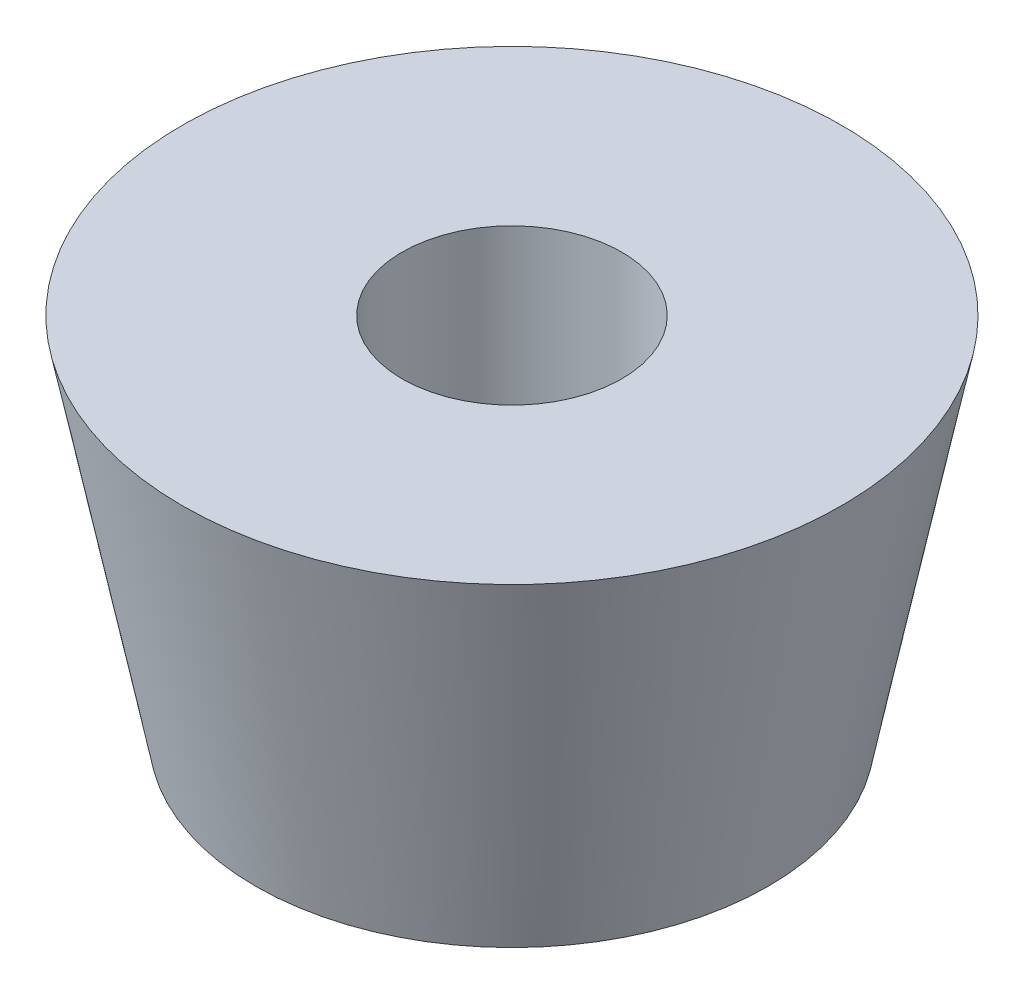
ISO-10303-21;
HEADER;
FILE_DESCRIPTION(('STEP AP214'),'2;1');
FILE_NAME('part.step','',(''),(''),'','','');
FILE_SCHEMA(('AUTOMOTIVE_DESIGN { 1 0 10303 214 1 1 1 1 }'));
ENDSEC;
DATA;
#1=APPLICATION_CONTEXT('core data for automotive mechanical design processes');
#2=APPLICATION_PROTOCOL_DEFINITION('international standard','automotive_design',2000,#1);
#3=PRODUCT_CONTEXT('',#1,'mechanical');
#4=PRODUCT('Part','Part','',(#3));
#5=PRODUCT_RELATED_PRODUCT_CATEGORY('part','',(#4));
#6=PRODUCT_DEFINITION_FORMATION('','',#4);
#7=PRODUCT_DEFINITION_CONTEXT('part definition',#1,'design');
#8=PRODUCT_DEFINITION('design','',#6,#7);
#9=PRODUCT_DEFINITION_SHAPE('','',#8);
#10=(LENGTH_UNIT() NAMED_UNIT(*) SI_UNIT(.MILLI.,.METRE.));
#11=(NAMED_UNIT(*) PLANE_ANGLE_UNIT() SI_UNIT($,.RADIAN.));
#12=(NAMED_UNIT(*) SI_UNIT($,.STERADIAN.) SOLID_ANGLE_UNIT());
#13=UNCERTAINTY_MEASURE_WITH_UNIT(LENGTH_MEASURE(1.E-05),#10,'distance_accuracy_value','');
#14=(GEOMETRIC_REPRESENTATION_CONTEXT(3) GLOBAL_UNCERTAINTY_ASSIGNED_CONTEXT((#13)) GLOBAL_UNIT_ASSIGNED_CONTEXT((#10,
#11,#12)) REPRESENTATION_CONTEXT('',''));
#15=CARTESIAN_POINT('',(0.,0.,0.));
#16=DIRECTION('',(0.,0.,1.));
#17=DIRECTION('',(1.,0.,0.));
#18=AXIS2_PLACEMENT_3D('',#15,#16,#17);
#19=CARTESIAN_POINT('',(0.,0.,-4.5));
#20=DIRECTION('',(0.,-1.,0.));
#21=DIRECTION('',(0.,0.,-1.));
#22=AXIS2_PLACEMENT_3D('',#19,#20,#21);
#23=PLANE('',#22);
#24=CARTESIAN_POINT('',(0.,0.,0.));
#25=DIRECTION('',(0.,1.,0.));
#26=DIRECTION('',(0.,0.,1.));
#27=AXIS2_PLACEMENT_3D('',#24,#25,#26);
#28=CIRCLE('',#27,1.5);
#29=CARTESIAN_POINT('',(0.,0.,1.5));
#30=VERTEX_POINT('',#29);
#31=EDGE_CURVE('E10',#30,#30,#28,.T.);
#32=ORIENTED_EDGE('',*,*,#31,.F.);
#33=EDGE_LOOP('',(#32));
#34=FACE_BOUND('',#33,.T.);
#35=CARTESIAN_POINT('',(0.,0.,0.));
#36=DIRECTION('',(0.,1.,0.));
#37=DIRECTION('',(0.,0.,1.));
#38=AXIS2_PLACEMENT_3D('',#35,#36,#37);
#39=CIRCLE('',#38,4.5);
#40=CARTESIAN_POINT('',(0.,0.,4.5));
#41=VERTEX_POINT('',#40);
#42=EDGE_CURVE('E49',#41,#41,#39,.T.);
#43=ORIENTED_EDGE('',*,*,#42,.T.);
#44=EDGE_LOOP('',(#43));
#45=FACE_BOUND('',#44,.T.);
#46=ADVANCED_FACE('F35',(#34,#45),#23,.F.);
#47=CARTESIAN_POINT('',(0.,0.,0.));
#48=DIRECTION('',(0.,1.,0.));
#49=DIRECTION('',(0.,0.,1.));
#50=AXIS2_PLACEMENT_3D('',#47,#48,#49);
#51=CYLINDRICAL_SURFACE('',#50,1.5);
#52=CARTESIAN_POINT('',(0.,-5.,0.));
#53=DIRECTION('',(0.,1.,0.));
#54=DIRECTION('',(0.,0.,1.));
#55=AXIS2_PLACEMENT_3D('',#52,#53,#54);
#56=CIRCLE('',#55,1.5);
#57=CARTESIAN_POINT('',(0.,-5.,1.5));
#58=VERTEX_POINT('',#57);
#59=EDGE_CURVE('E41',#58,#58,#56,.T.);
#60=ORIENTED_EDGE('',*,*,#59,.F.);
#61=EDGE_LOOP('',(#60));
#62=FACE_BOUND('',#61,.T.);
#63=ORIENTED_EDGE('',*,*,#31,.T.);
#64=EDGE_LOOP('',(#63));
#65=FACE_BOUND('',#64,.T.);
#66=ADVANCED_FACE('F64',(#62,#65),#51,.F.);
#67=CARTESIAN_POINT('',(0.,-5.,-1.5));
#68=DIRECTION('',(0.,1.,0.));
#69=DIRECTION('',(0.,0.,1.));
#70=AXIS2_PLACEMENT_3D('',#67,#68,#69);
#71=PLANE('',#70);
#72=CARTESIAN_POINT('',(0.,-5.,0.));
#73=DIRECTION('',(0.,1.,0.));
#74=DIRECTION('',(0.,0.,1.));
#75=AXIS2_PLACEMENT_3D('',#72,#73,#74);
#76=CIRCLE('',#75,3.5);
#77=CARTESIAN_POINT('',(0.,-5.,3.5));
#78=VERTEX_POINT('',#77);
#79=EDGE_CURVE('E45',#78,#78,#76,.T.);
#80=ORIENTED_EDGE('',*,*,#79,.F.);
#81=EDGE_LOOP('',(#80));
#82=FACE_BOUND('',#81,.T.);
#83=ORIENTED_EDGE('',*,*,#59,.T.);
#84=EDGE_LOOP('',(#83));
#85=FACE_BOUND('',#84,.T.);
#86=ADVANCED_FACE('F59',(#82,#85),#71,.F.);
#87=CARTESIAN_POINT('',(0.,-5.,0.));
#88=DIRECTION('',(0.,1.,0.));
#89=DIRECTION('',(0.,0.,1.));
#90=AXIS2_PLACEMENT_3D('',#87,#88,#89);
#91=CONICAL_SURFACE('',#90,3.5,0.197395559849881);
#92=ORIENTED_EDGE('',*,*,#42,.F.);
#93=EDGE_LOOP('',(#92));
#94=FACE_BOUND('',#93,.T.);
#95=ORIENTED_EDGE('',*,*,#79,.T.);
#96=EDGE_LOOP('',(#95));
#97=FACE_BOUND('',#96,.T.);
#98=ADVANCED_FACE('F56',(#94,#97),#91,.T.);
#99=CLOSED_SHELL('',(#46,#66,#86,#98));
#100=MANIFOLD_SOLID_BREP('B2',#99);
#101=ADVANCED_BREP_SHAPE_REPRESENTATION('',(#18,#100),#14);
#102=SHAPE_DEFINITION_REPRESENTATION(#9,#101);
ENDSEC;
END-ISO-10303-21;
